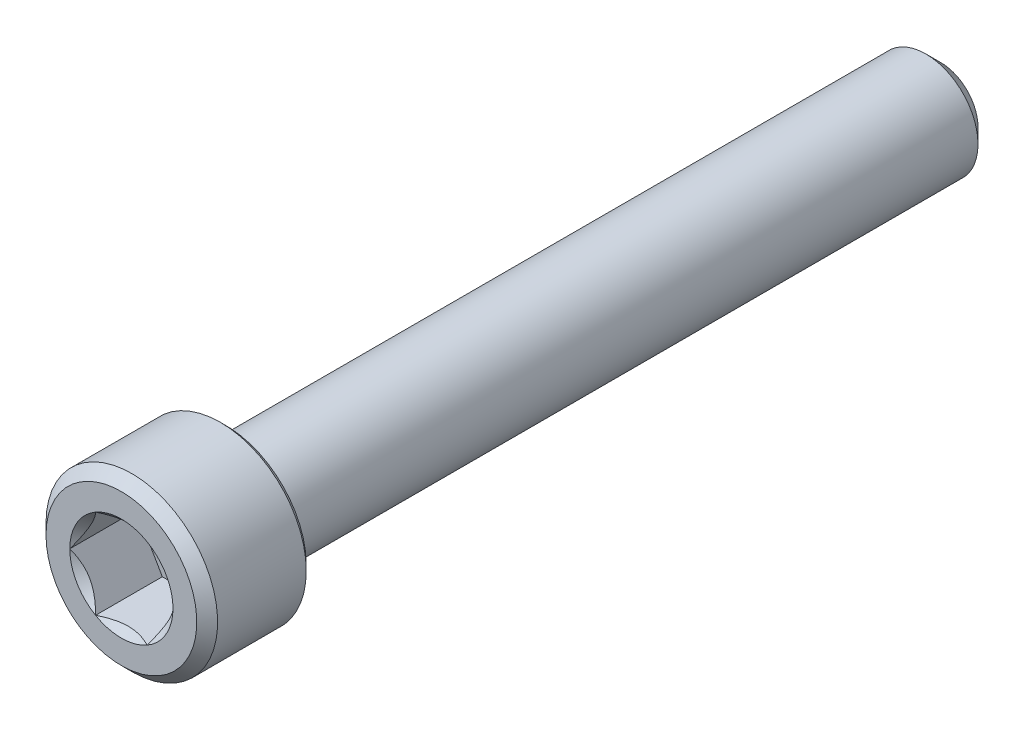
ISO-10303-21;
HEADER;
FILE_DESCRIPTION(('STEP AP214'),'2;1');
FILE_NAME('part.step','',(''),(''),'','','');
FILE_SCHEMA(('AUTOMOTIVE_DESIGN { 1 0 10303 214 1 1 1 1 }'));
ENDSEC;
DATA;
#1=APPLICATION_CONTEXT('core data for automotive mechanical design processes');
#2=APPLICATION_PROTOCOL_DEFINITION('international standard','automotive_design',2000,#1);
#3=PRODUCT_CONTEXT('',#1,'mechanical');
#4=PRODUCT('Part','Part','',(#3));
#5=PRODUCT_RELATED_PRODUCT_CATEGORY('part','',(#4));
#6=PRODUCT_DEFINITION_FORMATION('','',#4);
#7=PRODUCT_DEFINITION_CONTEXT('part definition',#1,'design');
#8=PRODUCT_DEFINITION('design','',#6,#7);
#9=PRODUCT_DEFINITION_SHAPE('','',#8);
#10=(LENGTH_UNIT() NAMED_UNIT(*) SI_UNIT(.MILLI.,.METRE.));
#11=(NAMED_UNIT(*) PLANE_ANGLE_UNIT() SI_UNIT($,.RADIAN.));
#12=(NAMED_UNIT(*) SI_UNIT($,.STERADIAN.) SOLID_ANGLE_UNIT());
#13=UNCERTAINTY_MEASURE_WITH_UNIT(LENGTH_MEASURE(1.E-05),#10,'distance_accuracy_value','');
#14=(GEOMETRIC_REPRESENTATION_CONTEXT(3) GLOBAL_UNCERTAINTY_ASSIGNED_CONTEXT((#13)) GLOBAL_UNIT_ASSIGNED_CONTEXT((#10,
#11,#12)) REPRESENTATION_CONTEXT('',''));
#15=CARTESIAN_POINT('',(0.,0.,0.));
#16=DIRECTION('',(0.,0.,1.));
#17=DIRECTION('',(1.,0.,0.));
#18=AXIS2_PLACEMENT_3D('',#15,#16,#17);
#19=CARTESIAN_POINT('',(0.,0.,30.0736));
#20=DIRECTION('',(0.,0.,1.));
#21=DIRECTION('',(1.,0.,0.));
#22=AXIS2_PLACEMENT_3D('',#19,#20,#21);
#23=PLANE('',#22);
#24=DIRECTION('',(0.5,-0.866025403784438,0.));
#25=VECTOR('',#24,1.);
#26=CARTESIAN_POINT('',(-2.06185637534076,0.,30.0736));
#27=LINE('',#26,#25);
#28=CARTESIAN_POINT('',(-2.06185637534076,0.,30.0736));
#29=VERTEX_POINT('',#28);
#30=CARTESIAN_POINT('',(-1.03092818767038,-1.78562,30.0736));
#31=VERTEX_POINT('',#30);
#32=EDGE_CURVE('E115',#29,#31,#27,.T.);
#33=ORIENTED_EDGE('',*,*,#32,.T.);
#34=DIRECTION('',(1.,0.,0.));
#35=VECTOR('',#34,1.);
#36=CARTESIAN_POINT('',(-1.03092818767038,-1.78562,30.0736));
#37=LINE('',#36,#35);
#38=CARTESIAN_POINT('',(1.03092818767038,-1.78562,30.0736));
#39=VERTEX_POINT('',#38);
#40=EDGE_CURVE('E82',#31,#39,#37,.T.);
#41=ORIENTED_EDGE('',*,*,#40,.T.);
#42=DIRECTION('',(0.5,0.866025403784439,0.));
#43=VECTOR('',#42,1.);
#44=CARTESIAN_POINT('',(1.03092818767038,-1.78562,30.0736));
#45=LINE('',#44,#43);
#46=CARTESIAN_POINT('',(2.06185637534076,0.,30.0736));
#47=VERTEX_POINT('',#46);
#48=EDGE_CURVE('E84',#39,#47,#45,.T.);
#49=ORIENTED_EDGE('',*,*,#48,.T.);
#50=DIRECTION('',(-0.5,0.866025403784439,0.));
#51=VECTOR('',#50,1.);
#52=CARTESIAN_POINT('',(2.06185637534076,0.,30.0736));
#53=LINE('',#52,#51);
#54=CARTESIAN_POINT('',(1.03092818767038,1.78562,30.0736));
#55=VERTEX_POINT('',#54);
#56=EDGE_CURVE('E85',#47,#55,#53,.T.);
#57=ORIENTED_EDGE('',*,*,#56,.T.);
#58=DIRECTION('',(-1.,0.,0.));
#59=VECTOR('',#58,1.);
#60=CARTESIAN_POINT('',(1.03092818767038,1.78562,30.0736));
#61=LINE('',#60,#59);
#62=CARTESIAN_POINT('',(-1.03092818767038,1.78562,30.0736));
#63=VERTEX_POINT('',#62);
#64=EDGE_CURVE('E71',#55,#63,#61,.T.);
#65=ORIENTED_EDGE('',*,*,#64,.T.);
#66=DIRECTION('',(-0.5,-0.866025403784439,0.));
#67=VECTOR('',#66,1.);
#68=CARTESIAN_POINT('',(-1.03092818767038,1.78562,30.0736));
#69=LINE('',#68,#67);
#70=EDGE_CURVE('E110',#63,#29,#69,.T.);
#71=ORIENTED_EDGE('',*,*,#70,.T.);
#72=EDGE_LOOP('',(#33,#41,#49,#57,#65,#71));
#73=FACE_BOUND('',#72,.T.);
#74=ADVANCED_FACE('F17',(#73),#23,.T.);
#75=CARTESIAN_POINT('',(2.06185637534076,0.,30.0736));
#76=DIRECTION('',(0.866025403784439,0.5,0.));
#77=DIRECTION('',(-0.5,0.866025403784439,0.));
#78=AXIS2_PLACEMENT_3D('',#75,#76,#77);
#79=PLANE('',#78);
#80=CARTESIAN_POINT('',(2.06185637534184,-1.87021565505749E-12,32.7406000000041));
#81=CARTESIAN_POINT('',(2.02642287007562,0.0613726314094752,32.7052004995166));
#82=CARTESIAN_POINT('',(1.99039691583455,0.123771414546173,32.6718804146153));
#83=CARTESIAN_POINT('',(1.9169362980726,0.251008936865267,32.6108727616067));
#84=CARTESIAN_POINT('',(1.8794946522605,0.315859769730815,32.5832191270456));
#85=CARTESIAN_POINT('',(1.80399541010736,0.446628293073005,32.535848264898));
#86=CARTESIAN_POINT('',(1.76595703078219,0.512512698701769,32.5160120045732));
#87=CARTESIAN_POINT('',(1.68904308953817,0.645731552746788,32.4854504677353));
#88=CARTESIAN_POINT('',(1.65016987554121,0.713061934443009,32.4747023867414));
#89=CARTESIAN_POINT('',(1.58317010137767,0.829108947389912,32.4650045880257));
#90=CARTESIAN_POINT('',(1.55513003782825,0.87767576210496,32.4635694330325));
#91=CARTESIAN_POINT('',(1.49909578618237,0.974729932919726,32.4659903582832));
#92=CARTESIAN_POINT('',(1.47110161760838,1.02321725520553,32.4698482931523));
#93=CARTESIAN_POINT('',(1.41538537197334,1.11972062345241,32.4826340723218));
#94=CARTESIAN_POINT('',(1.38766354396567,1.16773623804037,32.4915661844237));
#95=CARTESIAN_POINT('',(1.33268389705775,1.26296377986708,32.5140154678973));
#96=CARTESIAN_POINT('',(1.30542630540885,1.31017531349495,32.5275348206843));
#97=CARTESIAN_POINT('',(1.23563624998288,1.43105523535577,32.5676550620315));
#98=CARTESIAN_POINT('',(1.19353588652263,1.50397520388604,32.5972754050953));
#99=CARTESIAN_POINT('',(1.13163053076445,1.61119842531984,32.6472771620127));
#100=CARTESIAN_POINT('',(1.11122988523966,1.64653337987598,32.6648452543044));
#101=CARTESIAN_POINT('',(1.07080633249522,1.71654902705178,32.7015826683191));
#102=CARTESIAN_POINT('',(1.05078320287217,1.75123010488545,32.7207510087135));
#103=CARTESIAN_POINT('',(1.0309281876693,1.78562000000187,32.7406000000041));
#104=B_SPLINE_CURVE_WITH_KNOTS('',3,(#80,#81,#82,#83,#84,#85,#86,#87,#88,#89,#90,#91,#92,#93,
#94,#95,#96,#97,#98,#99,#100,#101,#102,#103),.UNSPECIFIED.,.F.,.F.,(4,2,2,2,2,2,2,2,2,2,2,4),
(0.,0.237814133073906,0.477013279274041,0.712414751828504,0.947223776272302,1.11528104359305,
1.28339721088455,1.45165498753189,1.61999288984356,1.88720880279873,2.0204543003604,
2.15361867898024),.UNSPECIFIED.);
#105=CARTESIAN_POINT('',(2.06185637534474,0.,32.740600000007));
#106=VERTEX_POINT('',#105);
#107=CARTESIAN_POINT('',(1.03092818767781,1.78562000000094,32.7406000000076));
#108=VERTEX_POINT('',#107);
#109=EDGE_CURVE('E20',#106,#108,#104,.T.);
#110=ORIENTED_EDGE('',*,*,#109,.T.);
#111=DIRECTION('',(0.,0.,1.));
#112=VECTOR('',#111,1.);
#113=CARTESIAN_POINT('',(1.03092818767038,1.78562,30.0736));
#114=LINE('',#113,#112);
#115=EDGE_CURVE('E90',#108,#55,#114,.F.);
#116=ORIENTED_EDGE('',*,*,#115,.T.);
#117=ORIENTED_EDGE('',*,*,#56,.F.);
#118=DIRECTION('',(0.,0.,1.));
#119=VECTOR('',#118,1.);
#120=CARTESIAN_POINT('',(2.06185637534076,0.,30.0736));
#121=LINE('',#120,#119);
#122=EDGE_CURVE('E58',#47,#106,#121,.T.);
#123=ORIENTED_EDGE('',*,*,#122,.T.);
#124=EDGE_LOOP('',(#110,#116,#117,#123));
#125=FACE_BOUND('',#124,.T.);
#126=ADVANCED_FACE('F89',(#125),#79,.F.);
#127=CARTESIAN_POINT('',(1.03092818767038,-1.78562,30.0736));
#128=DIRECTION('',(0.866025403784439,-0.5,0.));
#129=DIRECTION('',(0.5,0.866025403784439,0.));
#130=AXIS2_PLACEMENT_3D('',#127,#128,#129);
#131=PLANE('',#130);
#132=CARTESIAN_POINT('',(1.0309281876693,-1.78562000000187,32.7406000000041));
#133=CARTESIAN_POINT('',(1.06636169293551,-1.72424736859053,32.7052004995166));
#134=CARTESIAN_POINT('',(1.10238764717659,-1.66184858545383,32.6718804146153));
#135=CARTESIAN_POINT('',(1.17584826493854,-1.53461106313473,32.6108727616067));
#136=CARTESIAN_POINT('',(1.21328991075064,-1.46976023026919,32.5832191270456));
#137=CARTESIAN_POINT('',(1.28878915290378,-1.338991706927,32.535848264898));
#138=CARTESIAN_POINT('',(1.32682753222895,-1.27310730129823,32.5160120045732));
#139=CARTESIAN_POINT('',(1.40374147347297,-1.13988844725321,32.4854504677353));
#140=CARTESIAN_POINT('',(1.44261468746992,-1.07255806555699,32.4747023867414));
#141=CARTESIAN_POINT('',(1.50961446163347,-0.956511052610089,32.4650045880257));
#142=CARTESIAN_POINT('',(1.53765452518289,-0.907944237895041,32.4635694330325));
#143=CARTESIAN_POINT('',(1.59368877682877,-0.810890067080274,32.4659903582832));
#144=CARTESIAN_POINT('',(1.62168294540276,-0.762402744794476,32.4698482931523));
#145=CARTESIAN_POINT('',(1.6773991910378,-0.665899376547594,32.4826340723218));
#146=CARTESIAN_POINT('',(1.70512101904547,-0.617883761959627,32.4915661844237));
#147=CARTESIAN_POINT('',(1.76010066595338,-0.522656220132923,32.5140154678973));
#148=CARTESIAN_POINT('',(1.78735825760229,-0.475444686505049,32.5275348206843));
#149=CARTESIAN_POINT('',(1.85714831302826,-0.354564764644227,32.5676550620315));
#150=CARTESIAN_POINT('',(1.8992486764885,-0.281644796113963,32.5972754050953));
#151=CARTESIAN_POINT('',(1.96115403224669,-0.174421574680155,32.6472771620127));
#152=CARTESIAN_POINT('',(1.98155467777148,-0.139086620124017,32.6648452543044));
#153=CARTESIAN_POINT('',(2.02197823051592,-0.0690709729482142,32.7015826683191));
#154=CARTESIAN_POINT('',(2.04200136013897,-0.0343898951145474,32.7207510087135));
#155=CARTESIAN_POINT('',(2.06185637534184,1.87207923570105E-12,32.7406000000041));
#156=B_SPLINE_CURVE_WITH_KNOTS('',3,(#132,#133,#134,#135,#136,#137,#138,#139,#140,#141,#142,
#143,#144,#145,#146,#147,#148,#149,#150,#151,#152,#153,#154,#155),.UNSPECIFIED.,.F.,.F.,(4,2,2,
2,2,2,2,2,2,2,2,4),(0.,0.237814133073905,0.477013279274041,0.712414751828502,0.947223776272302,
1.11528104359305,1.28339721088455,1.45165498753188,1.61999288984356,1.88720880279873,
2.0204543003604,2.15361867898025),.UNSPECIFIED.);
#157=CARTESIAN_POINT('',(1.03092818767237,-1.78562000000345,32.740600000007));
#158=VERTEX_POINT('',#157);
#159=EDGE_CURVE('E94',#158,#106,#156,.T.);
#160=ORIENTED_EDGE('',*,*,#159,.T.);
#161=ORIENTED_EDGE('',*,*,#122,.F.);
#162=ORIENTED_EDGE('',*,*,#48,.F.);
#163=DIRECTION('',(0.,0.,-1.));
#164=VECTOR('',#163,1.);
#165=CARTESIAN_POINT('',(1.03092818767038,-1.78562,30.0736));
#166=LINE('',#165,#164);
#167=EDGE_CURVE('E96',#39,#158,#166,.F.);
#168=ORIENTED_EDGE('',*,*,#167,.T.);
#169=EDGE_LOOP('',(#160,#161,#162,#168));
#170=FACE_BOUND('',#169,.T.);
#171=ADVANCED_FACE('F92',(#170),#131,.F.);
#172=CARTESIAN_POINT('',(-1.03092818767038,-1.78562,30.0736));
#173=DIRECTION('',(0.,-1.,0.));
#174=DIRECTION('',(0.,0.,-1.));
#175=AXIS2_PLACEMENT_3D('',#172,#173,#174);
#176=PLANE('',#175);
#177=CARTESIAN_POINT('',(-1.03092818767254,-1.78562,32.7406000000041));
#178=CARTESIAN_POINT('',(-0.960061177127587,-1.78562,32.7052004995176));
#179=CARTESIAN_POINT('',(-0.888009268632836,-1.78562,32.6718804146178));
#180=CARTESIAN_POINT('',(-0.741088033083753,-1.78562,32.6108727616135));
#181=CARTESIAN_POINT('',(-0.666204741446977,-1.78562,32.5832191270553));
#182=CARTESIAN_POINT('',(-0.515206257116187,-1.78562,32.5358482649152));
#183=CARTESIAN_POINT('',(-0.43912949845394,-1.78562,32.5160120045949));
#184=CARTESIAN_POINT('',(-0.28530161594267,-1.78562,32.4854504677676));
#185=CARTESIAN_POINT('',(-0.207555187937457,-1.78562,32.4747023867798));
#186=CARTESIAN_POINT('',(-0.0735556395841561,-1.78562,32.465004588075));
#187=CARTESIAN_POINT('',(-0.0174755124701572,-1.78562,32.4635694330869));
#188=CARTESIAN_POINT('',(0.0945929908513759,-1.78562,32.4659903583497));
#189=CARTESIAN_POINT('',(0.150581328013958,-1.78562,32.4698482932257));
#190=CARTESIAN_POINT('',(0.262013819312583,-1.78562,32.4826340724102));
#191=CARTESIAN_POINT('',(0.317457475341856,-1.78562,32.4915661845202));
#192=CARTESIAN_POINT('',(0.427416769184933,-1.78562,32.5140154680107));
#193=CARTESIAN_POINT('',(0.481931952496061,-1.78562,32.5275348208065));
#194=CARTESIAN_POINT('',(0.621512063303938,-1.78562,32.5676550621545));
#195=CARTESIAN_POINT('',(0.705712790169282,-1.78562,32.5972754052014));
#196=CARTESIAN_POINT('',(0.829523501606724,-1.78562,32.6472771620848));
#197=CARTESIAN_POINT('',(0.87032479263054,-1.78562,32.6648452543636));
#198=CARTESIAN_POINT('',(0.951171898069165,-1.78562,32.7015826683503));
#199=CARTESIAN_POINT('',(0.991218157290788,-1.78562,32.7207510087296));
#200=CARTESIAN_POINT('',(1.03092818767254,-1.78562,32.7406000000041));
#201=B_SPLINE_CURVE_WITH_KNOTS('',3,(#177,#178,#179,#180,#181,#182,#183,#184,#185,#186,#187,
#188,#189,#190,#191,#192,#193,#194,#195,#196,#197,#198,#199,#200),.UNSPECIFIED.,.F.,.F.,(4,2,2,
2,2,2,2,2,2,2,2,4),(0.,0.237814133106243,0.47701327933873,0.712414751924246,0.94722377639907,
1.11528104376481,1.28339721110135,1.45165498779379,1.61999289015057,1.88720880293443,
2.0204543004099,2.15361867894394),.UNSPECIFIED.);
#202=CARTESIAN_POINT('',(-1.03092818767237,-1.78562000000345,32.740600000007));
#203=VERTEX_POINT('',#202);
#204=EDGE_CURVE('E197',#203,#158,#201,.T.);
#205=ORIENTED_EDGE('',*,*,#204,.T.);
#206=ORIENTED_EDGE('',*,*,#167,.F.);
#207=ORIENTED_EDGE('',*,*,#40,.F.);
#208=DIRECTION('',(0.,0.,1.));
#209=VECTOR('',#208,1.);
#210=CARTESIAN_POINT('',(-1.03092818767038,-1.78562,30.0736));
#211=LINE('',#210,#209);
#212=EDGE_CURVE('E112',#31,#203,#211,.T.);
#213=ORIENTED_EDGE('',*,*,#212,.T.);
#214=EDGE_LOOP('',(#205,#206,#207,#213));
#215=FACE_BOUND('',#214,.T.);
#216=ADVANCED_FACE('F206',(#215),#176,.F.);
#217=CARTESIAN_POINT('',(-2.06185637534076,0.,30.0736));
#218=DIRECTION('',(-0.866025403784438,-0.5,0.));
#219=DIRECTION('',(0.5,-0.866025403784438,0.));
#220=AXIS2_PLACEMENT_3D('',#217,#218,#219);
#221=PLANE('',#220);
#222=CARTESIAN_POINT('',(-2.06185637534184,1.87116226081698E-12,32.7406000000041));
#223=CARTESIAN_POINT('',(-2.02642287007562,-0.061372631409474,32.7052004995166));
#224=CARTESIAN_POINT('',(-1.99039691583455,-0.123771414546172,32.6718804146153));
#225=CARTESIAN_POINT('',(-1.9169362980726,-0.251008936865266,32.6108727616067));
#226=CARTESIAN_POINT('',(-1.8794946522605,-0.315859769730814,32.5832191270456));
#227=CARTESIAN_POINT('',(-1.80399541010736,-0.446628293073004,32.535848264898));
#228=CARTESIAN_POINT('',(-1.76595703078219,-0.512512698701769,32.5160120045732));
#229=CARTESIAN_POINT('',(-1.68904308953817,-0.645731552746788,32.4854504677353));
#230=CARTESIAN_POINT('',(-1.65016987554121,-0.713061934443008,32.4747023867414));
#231=CARTESIAN_POINT('',(-1.58317010137767,-0.829108947389912,32.4650045880257));
#232=CARTESIAN_POINT('',(-1.55513003782825,-0.877675762104959,32.4635694330325));
#233=CARTESIAN_POINT('',(-1.49909578618237,-0.974729932919726,32.4659903582832));
#234=CARTESIAN_POINT('',(-1.47110161760838,-1.02321725520552,32.4698482931523));
#235=CARTESIAN_POINT('',(-1.41538537197334,-1.11972062345241,32.4826340723218));
#236=CARTESIAN_POINT('',(-1.38766354396567,-1.16773623804037,32.4915661844237));
#237=CARTESIAN_POINT('',(-1.33268389705775,-1.26296377986708,32.5140154678973));
#238=CARTESIAN_POINT('',(-1.30542630540885,-1.31017531349495,32.5275348206843));
#239=CARTESIAN_POINT('',(-1.23563624998288,-1.43105523535577,32.5676550620315));
#240=CARTESIAN_POINT('',(-1.19353588652263,-1.50397520388604,32.5972754050953));
#241=CARTESIAN_POINT('',(-1.13163053076444,-1.61119842531984,32.6472771620127));
#242=CARTESIAN_POINT('',(-1.11122988523966,-1.64653337987598,32.6648452543044));
#243=CARTESIAN_POINT('',(-1.07080633249522,-1.71654902705179,32.7015826683191));
#244=CARTESIAN_POINT('',(-1.05078320287217,-1.75123010488545,32.7207510087135));
#245=CARTESIAN_POINT('',(-1.0309281876693,-1.78562000000187,32.7406000000041));
#246=B_SPLINE_CURVE_WITH_KNOTS('',3,(#222,#223,#224,#225,#226,#227,#228,#229,#230,#231,#232,
#233,#234,#235,#236,#237,#238,#239,#240,#241,#242,#243,#244,#245),.UNSPECIFIED.,.F.,.F.,(4,2,2,
2,2,2,2,2,2,2,2,4),(0.,0.237814133073906,0.477013279274041,0.712414751828504,0.947223776272303,
1.11528104359306,1.28339721088455,1.45165498753189,1.61999288984356,1.88720880279873,
2.0204543003604,2.15361867898025),.UNSPECIFIED.);
#247=CARTESIAN_POINT('',(-2.06185637534474,0.,32.740600000007));
#248=VERTEX_POINT('',#247);
#249=EDGE_CURVE('E190',#248,#203,#246,.T.);
#250=ORIENTED_EDGE('',*,*,#249,.T.);
#251=ORIENTED_EDGE('',*,*,#212,.F.);
#252=ORIENTED_EDGE('',*,*,#32,.F.);
#253=DIRECTION('',(0.,0.,1.));
#254=VECTOR('',#253,1.);
#255=CARTESIAN_POINT('',(-2.06185637534076,0.,30.0736));
#256=LINE('',#255,#254);
#257=EDGE_CURVE('E107',#29,#248,#256,.T.);
#258=ORIENTED_EDGE('',*,*,#257,.T.);
#259=EDGE_LOOP('',(#250,#251,#252,#258));
#260=FACE_BOUND('',#259,.T.);
#261=ADVANCED_FACE('F202',(#260),#221,.F.);
#262=CARTESIAN_POINT('',(-1.03092818767038,1.78562,30.0736));
#263=DIRECTION('',(-0.866025403784439,0.5,0.));
#264=DIRECTION('',(-0.5,-0.866025403784439,0.));
#265=AXIS2_PLACEMENT_3D('',#262,#263,#264);
#266=PLANE('',#265);
#267=CARTESIAN_POINT('',(-1.0309281876693,1.78562000000187,32.7406000000041));
#268=CARTESIAN_POINT('',(-1.06636169293552,1.72424736859053,32.7052004995166));
#269=CARTESIAN_POINT('',(-1.10238764717659,1.66184858545383,32.6718804146153));
#270=CARTESIAN_POINT('',(-1.17584826493854,1.53461106313473,32.6108727616067));
#271=CARTESIAN_POINT('',(-1.21328991075064,1.46976023026919,32.5832191270456));
#272=CARTESIAN_POINT('',(-1.28878915290378,1.338991706927,32.535848264898));
#273=CARTESIAN_POINT('',(-1.32682753222895,1.27310730129823,32.5160120045732));
#274=CARTESIAN_POINT('',(-1.40374147347297,1.13988844725321,32.4854504677353));
#275=CARTESIAN_POINT('',(-1.44261468746993,1.07255806555699,32.4747023867414));
#276=CARTESIAN_POINT('',(-1.50961446163347,0.956511052610089,32.4650045880257));
#277=CARTESIAN_POINT('',(-1.53765452518289,0.907944237895041,32.4635694330325));
#278=CARTESIAN_POINT('',(-1.59368877682877,0.810890067080275,32.4659903582832));
#279=CARTESIAN_POINT('',(-1.62168294540276,0.762402744794476,32.4698482931523));
#280=CARTESIAN_POINT('',(-1.6773991910378,0.665899376547594,32.4826340723218));
#281=CARTESIAN_POINT('',(-1.70512101904547,0.617883761959628,32.4915661844237));
#282=CARTESIAN_POINT('',(-1.76010066595338,0.522656220132923,32.5140154678973));
#283=CARTESIAN_POINT('',(-1.78735825760229,0.47544468650505,32.5275348206843));
#284=CARTESIAN_POINT('',(-1.85714831302826,0.354564764644227,32.5676550620315));
#285=CARTESIAN_POINT('',(-1.89924867648851,0.281644796113964,32.5972754050953));
#286=CARTESIAN_POINT('',(-1.96115403224669,0.174421574680157,32.6472771620127));
#287=CARTESIAN_POINT('',(-1.98155467777148,0.139086620124018,32.6648452543044));
#288=CARTESIAN_POINT('',(-2.02197823051592,0.069070972948216,32.7015826683191));
#289=CARTESIAN_POINT('',(-2.04200136013897,0.0343898951145491,32.7207510087135));
#290=CARTESIAN_POINT('',(-2.06185637534184,-1.8704331825972E-12,32.7406000000041));
#291=B_SPLINE_CURVE_WITH_KNOTS('',3,(#267,#268,#269,#270,#271,#272,#273,#274,#275,#276,#277,
#278,#279,#280,#281,#282,#283,#284,#285,#286,#287,#288,#289,#290),.UNSPECIFIED.,.F.,.F.,(4,2,2,
2,2,2,2,2,2,2,2,4),(0.,0.237814133073906,0.477013279274041,0.712414751828502,0.947223776272302,
1.11528104359305,1.28339721088455,1.45165498753188,1.61999288984356,1.88720880279873,
2.0204543003604,2.15361867898024),.UNSPECIFIED.);
#292=CARTESIAN_POINT('',(-1.03092818767237,1.78562000000345,32.740600000007));
#293=VERTEX_POINT('',#292);
#294=EDGE_CURVE('E161',#293,#248,#291,.T.);
#295=ORIENTED_EDGE('',*,*,#294,.T.);
#296=ORIENTED_EDGE('',*,*,#257,.F.);
#297=ORIENTED_EDGE('',*,*,#70,.F.);
#298=DIRECTION('',(0.,0.,1.));
#299=VECTOR('',#298,1.);
#300=CARTESIAN_POINT('',(-1.03092818767038,1.78562,30.0736));
#301=LINE('',#300,#299);
#302=EDGE_CURVE('E39',#63,#293,#301,.T.);
#303=ORIENTED_EDGE('',*,*,#302,.T.);
#304=EDGE_LOOP('',(#295,#296,#297,#303));
#305=FACE_BOUND('',#304,.T.);
#306=ADVANCED_FACE('F205',(#305),#266,.F.);
#307=CARTESIAN_POINT('',(1.03092818767038,1.78562,30.0736));
#308=DIRECTION('',(0.,1.,0.));
#309=DIRECTION('',(-1.,0.,0.));
#310=AXIS2_PLACEMENT_3D('',#307,#308,#309);
#311=PLANE('',#310);
#312=CARTESIAN_POINT('',(1.03092818767254,1.78562,32.7406000000041));
#313=CARTESIAN_POINT('',(0.960061177140108,1.78562,32.7052004995166));
#314=CARTESIAN_POINT('',(0.888009268657953,1.78562,32.6718804146153));
#315=CARTESIAN_POINT('',(0.741088033134053,1.78562,32.6108727616067));
#316=CARTESIAN_POINT('',(0.666204741509862,1.78562,32.5832191270456));
#317=CARTESIAN_POINT('',(0.515206257203576,1.78562,32.535848264898));
#318=CARTESIAN_POINT('',(0.439129498553245,1.78562,32.5160120045732));
#319=CARTESIAN_POINT('',(0.285301616065195,1.78562,32.4854504677353));
#320=CARTESIAN_POINT('',(0.207555188071288,1.78562,32.4747023867414));
#321=CARTESIAN_POINT('',(0.0735556397441945,1.78562,32.4650045880257));
#322=CARTESIAN_POINT('',(0.0174755126453635,1.78562,32.4635694330325));
#323=CARTESIAN_POINT('',(-0.0945929906463993,1.78562,32.4659903582832));
#324=CARTESIAN_POINT('',(-0.15058132779438,1.78562,32.4698482931523));
#325=CARTESIAN_POINT('',(-0.262013819064465,1.78562,32.4826340723218));
#326=CARTESIAN_POINT('',(-0.3174574750798,1.78562,32.4915661844237));
#327=CARTESIAN_POINT('',(-0.427416768895629,1.78562,32.5140154678973));
#328=CARTESIAN_POINT('',(-0.481931952193445,1.78562,32.5275348206843));
#329=CARTESIAN_POINT('',(-0.621512063045379,1.78562,32.5676550620315));
#330=CARTESIAN_POINT('',(-0.705712789965875,1.78562,32.5972754050952));
#331=CARTESIAN_POINT('',(-0.829523501482249,1.78562,32.6472771620127));
#332=CARTESIAN_POINT('',(-0.870324792531827,1.78562,32.6648452543044));
#333=CARTESIAN_POINT('',(-0.951171898020696,1.78562,32.7015826683191));
#334=CARTESIAN_POINT('',(-0.991218157266803,1.78562,32.7207510087136));
#335=CARTESIAN_POINT('',(-1.03092818767254,1.78562,32.7406000000041));
#336=B_SPLINE_CURVE_WITH_KNOTS('',3,(#312,#313,#314,#315,#316,#317,#318,#319,#320,#321,#322,
#323,#324,#325,#326,#327,#328,#329,#330,#331,#332,#333,#334,#335),.UNSPECIFIED.,.F.,.F.,(4,2,2,
2,2,2,2,2,2,2,2,4),(0.,0.237814133073906,0.477013279274041,0.712414751828502,0.947223776272302,
1.11528104359305,1.28339721088455,1.45165498753188,1.61999288984356,1.88720880279873,
2.0204543003604,2.15361867898024),.UNSPECIFIED.);
#337=EDGE_CURVE('E154',#108,#293,#336,.T.);
#338=ORIENTED_EDGE('',*,*,#337,.T.);
#339=ORIENTED_EDGE('',*,*,#302,.F.);
#340=ORIENTED_EDGE('',*,*,#64,.F.);
#341=ORIENTED_EDGE('',*,*,#115,.F.);
#342=EDGE_LOOP('',(#338,#339,#340,#341));
#343=FACE_BOUND('',#342,.T.);
#344=ADVANCED_FACE('F168',(#343),#311,.F.);
#345=CARTESIAN_POINT('',(0.,0.,32.7405999999542));
#346=DIRECTION('',(0.,0.,1.));
#347=DIRECTION('',(1.,0.,0.));
#348=AXIS2_PLACEMENT_3D('',#345,#346,#347);
#349=CONICAL_SURFACE('',#348,2.06185637529188,0.785398163397448);
#350=ORIENTED_EDGE('',*,*,#109,.F.);
#351=CARTESIAN_POINT('',(0.,0.,32.740600000011));
#352=DIRECTION('',(0.,0.,1.));
#353=DIRECTION('',(1.,0.,0.));
#354=AXIS2_PLACEMENT_3D('',#351,#352,#353);
#355=CIRCLE('',#354,2.06185637534873);
#356=EDGE_CURVE('E151',#108,#106,#355,.F.);
#357=ORIENTED_EDGE('',*,*,#356,.F.);
#358=EDGE_LOOP('',(#350,#357));
#359=FACE_BOUND('',#358,.T.);
#360=ADVANCED_FACE('F222',(#359),#349,.F.);
#361=CARTESIAN_POINT('',(0.,0.,32.7405999999542));
#362=DIRECTION('',(0.,0.,1.));
#363=DIRECTION('',(1.,0.,0.));
#364=AXIS2_PLACEMENT_3D('',#361,#362,#363);
#365=CONICAL_SURFACE('',#364,2.06185637529188,0.785398163397448);
#366=ORIENTED_EDGE('',*,*,#159,.F.);
#367=CARTESIAN_POINT('',(0.,0.,32.740600000011));
#368=DIRECTION('',(0.,0.,1.));
#369=DIRECTION('',(1.,0.,0.));
#370=AXIS2_PLACEMENT_3D('',#367,#368,#369);
#371=CIRCLE('',#370,2.06185637534873);
#372=EDGE_CURVE('E148',#106,#158,#371,.F.);
#373=ORIENTED_EDGE('',*,*,#372,.F.);
#374=EDGE_LOOP('',(#366,#373));
#375=FACE_BOUND('',#374,.T.);
#376=ADVANCED_FACE('F219',(#375),#365,.F.);
#377=CARTESIAN_POINT('',(0.,0.,32.7405999999542));
#378=DIRECTION('',(0.,0.,1.));
#379=DIRECTION('',(1.,0.,0.));
#380=AXIS2_PLACEMENT_3D('',#377,#378,#379);
#381=CONICAL_SURFACE('',#380,2.06185637529188,0.785398163499717);
#382=ORIENTED_EDGE('',*,*,#204,.F.);
#383=CARTESIAN_POINT('',(0.,0.,32.740600000011));
#384=DIRECTION('',(0.,0.,1.));
#385=DIRECTION('',(1.,0.,0.));
#386=AXIS2_PLACEMENT_3D('',#383,#384,#385);
#387=CIRCLE('',#386,2.06185637534873);
#388=EDGE_CURVE('E145',#158,#203,#387,.F.);
#389=ORIENTED_EDGE('',*,*,#388,.F.);
#390=EDGE_LOOP('',(#382,#389));
#391=FACE_BOUND('',#390,.T.);
#392=ADVANCED_FACE('F186',(#391),#381,.F.);
#393=CARTESIAN_POINT('',(0.,0.,32.7405999999542));
#394=DIRECTION('',(0.,0.,1.));
#395=DIRECTION('',(1.,0.,0.));
#396=AXIS2_PLACEMENT_3D('',#393,#394,#395);
#397=CONICAL_SURFACE('',#396,2.06185637529188,0.785398163397448);
#398=ORIENTED_EDGE('',*,*,#249,.F.);
#399=CARTESIAN_POINT('',(0.,0.,32.740600000011));
#400=DIRECTION('',(0.,0.,1.));
#401=DIRECTION('',(1.,0.,0.));
#402=AXIS2_PLACEMENT_3D('',#399,#400,#401);
#403=CIRCLE('',#402,2.06185637534873);
#404=EDGE_CURVE('E142',#203,#248,#403,.F.);
#405=ORIENTED_EDGE('',*,*,#404,.F.);
#406=EDGE_LOOP('',(#398,#405));
#407=FACE_BOUND('',#406,.T.);
#408=ADVANCED_FACE('F181',(#407),#397,.F.);
#409=CARTESIAN_POINT('',(0.,0.,32.7405999999542));
#410=DIRECTION('',(0.,0.,1.));
#411=DIRECTION('',(1.,0.,0.));
#412=AXIS2_PLACEMENT_3D('',#409,#410,#411);
#413=CONICAL_SURFACE('',#412,2.06185637529188,0.785398163397448);
#414=ORIENTED_EDGE('',*,*,#294,.F.);
#415=CARTESIAN_POINT('',(0.,0.,32.740600000011));
#416=DIRECTION('',(0.,0.,1.));
#417=DIRECTION('',(1.,0.,0.));
#418=AXIS2_PLACEMENT_3D('',#415,#416,#417);
#419=CIRCLE('',#418,2.06185637534873);
#420=EDGE_CURVE('E139',#248,#293,#419,.F.);
#421=ORIENTED_EDGE('',*,*,#420,.F.);
#422=EDGE_LOOP('',(#414,#421));
#423=FACE_BOUND('',#422,.T.);
#424=ADVANCED_FACE('F175',(#423),#413,.F.);
#425=CARTESIAN_POINT('',(0.,0.,32.7405999999542));
#426=DIRECTION('',(0.,0.,1.));
#427=DIRECTION('',(1.,0.,0.));
#428=AXIS2_PLACEMENT_3D('',#425,#426,#427);
#429=CONICAL_SURFACE('',#428,2.06185637529188,0.785398163397448);
#430=ORIENTED_EDGE('',*,*,#337,.F.);
#431=CARTESIAN_POINT('',(0.,0.,32.740600000011));
#432=DIRECTION('',(0.,0.,1.));
#433=DIRECTION('',(1.,0.,0.));
#434=AXIS2_PLACEMENT_3D('',#431,#432,#433);
#435=CIRCLE('',#434,2.06185637534873);
#436=EDGE_CURVE('E136',#293,#108,#435,.F.);
#437=ORIENTED_EDGE('',*,*,#436,.F.);
#438=EDGE_LOOP('',(#430,#437));
#439=FACE_BOUND('',#438,.T.);
#440=ADVANCED_FACE('F170',(#439),#429,.F.);
#441=CARTESIAN_POINT('',(0.,0.,32.7406));
#442=DIRECTION('',(0.,0.,1.));
#443=DIRECTION('',(1.,0.,0.));
#444=AXIS2_PLACEMENT_3D('',#441,#442,#443);
#445=PLANE('',#444);
#446=CARTESIAN_POINT('',(0.,0.,32.740600000011));
#447=DIRECTION('',(0.,0.,-1.));
#448=DIRECTION('',(-1.,0.,0.));
#449=AXIS2_PLACEMENT_3D('',#446,#447,#448);
#450=CIRCLE('',#449,3.01243999996359);
#451=CARTESIAN_POINT('',(-3.01243999996359,0.,32.740600000011));
#452=VERTEX_POINT('',#451);
#453=EDGE_CURVE('E132',#452,#452,#450,.T.);
#454=ORIENTED_EDGE('',*,*,#453,.F.);
#455=EDGE_LOOP('',(#454));
#456=FACE_BOUND('',#455,.T.);
#457=ORIENTED_EDGE('',*,*,#420,.T.);
#458=ORIENTED_EDGE('',*,*,#436,.T.);
#459=ORIENTED_EDGE('',*,*,#356,.T.);
#460=ORIENTED_EDGE('',*,*,#372,.T.);
#461=ORIENTED_EDGE('',*,*,#388,.T.);
#462=ORIENTED_EDGE('',*,*,#404,.T.);
#463=EDGE_LOOP('',(#457,#458,#459,#460,#461,#462));
#464=FACE_BOUND('',#463,.T.);
#465=ADVANCED_FACE('F174',(#456,#464),#445,.T.);
#466=CARTESIAN_POINT('',(0.,0.,32.3240399999349));
#467=DIRECTION('',(0.,0.,-1.));
#468=DIRECTION('',(-1.,0.,0.));
#469=AXIS2_PLACEMENT_3D('',#466,#467,#468);
#470=CONICAL_SURFACE('',#469,3.42900000003965,0.785398163397448);
#471=ORIENTED_EDGE('',*,*,#453,.T.);
#472=EDGE_LOOP('',(#471));
#473=FACE_BOUND('',#472,.T.);
#474=CARTESIAN_POINT('',(0.,0.,32.32404));
#475=DIRECTION('',(0.,0.,-1.));
#476=DIRECTION('',(-1.,0.,0.));
#477=AXIS2_PLACEMENT_3D('',#474,#475,#476);
#478=CIRCLE('',#477,3.429);
#479=CARTESIAN_POINT('',(-3.429,0.,32.32404));
#480=VERTEX_POINT('',#479);
#481=EDGE_CURVE('E135',#480,#480,#478,.T.);
#482=ORIENTED_EDGE('',*,*,#481,.F.);
#483=EDGE_LOOP('',(#482));
#484=FACE_BOUND('',#483,.T.);
#485=ADVANCED_FACE('F258',(#473,#484),#470,.T.);
#486=CARTESIAN_POINT('',(0.,0.,32.7406));
#487=DIRECTION('',(0.,0.,-1.));
#488=DIRECTION('',(-1.,0.,0.));
#489=AXIS2_PLACEMENT_3D('',#486,#487,#488);
#490=CYLINDRICAL_SURFACE('',#489,3.429);
#491=ORIENTED_EDGE('',*,*,#481,.T.);
#492=EDGE_LOOP('',(#491));
#493=FACE_BOUND('',#492,.T.);
#494=CARTESIAN_POINT('',(0.,0.,28.7832800000274));
#495=DIRECTION('',(0.,0.,1.));
#496=DIRECTION('',(1.,0.,0.));
#497=AXIS2_PLACEMENT_3D('',#494,#495,#496);
#498=CIRCLE('',#497,3.42900000003965);
#499=CARTESIAN_POINT('',(3.42900000003965,0.,28.7832800000274));
#500=VERTEX_POINT('',#499);
#501=EDGE_CURVE('E131',#500,#500,#498,.F.);
#502=ORIENTED_EDGE('',*,*,#501,.F.);
#503=EDGE_LOOP('',(#502));
#504=FACE_BOUND('',#503,.T.);
#505=ADVANCED_FACE('F255',(#493,#504),#490,.T.);
#506=CARTESIAN_POINT('',(0.,0.,28.7832799999705));
#507=DIRECTION('',(0.,0.,1.));
#508=DIRECTION('',(0.,-1.,0.));
#509=AXIS2_PLACEMENT_3D('',#506,#507,#508);
#510=CONICAL_SURFACE('',#509,3.42899999992596,0.785398163397448);
#511=CARTESIAN_POINT('',(0.,0.,28.5749999999894));
#512=DIRECTION('',(0.,0.,1.));
#513=DIRECTION('',(0.,-1.,0.));
#514=AXIS2_PLACEMENT_3D('',#511,#512,#513);
#515=CIRCLE('',#514,3.22071999994478);
#516=CARTESIAN_POINT('',(0.,-3.22071999994478,28.5749999999894));
#517=VERTEX_POINT('',#516);
#518=EDGE_CURVE('E128',#517,#517,#515,.T.);
#519=ORIENTED_EDGE('',*,*,#518,.T.);
#520=EDGE_LOOP('',(#519));
#521=FACE_BOUND('',#520,.T.);
#522=ORIENTED_EDGE('',*,*,#501,.T.);
#523=EDGE_LOOP('',(#522));
#524=FACE_BOUND('',#523,.T.);
#525=ADVANCED_FACE('F251',(#521,#524),#510,.T.);
#526=CARTESIAN_POINT('',(0.,0.,0.));
#527=DIRECTION('',(0.,0.,1.));
#528=DIRECTION('',(1.,0.,0.));
#529=AXIS2_PLACEMENT_3D('',#526,#527,#528);
#530=PLANE('',#529);
#531=CARTESIAN_POINT('',(0.,0.,0.));
#532=DIRECTION('',(0.,0.,1.));
#533=DIRECTION('',(1.,0.,0.));
#534=AXIS2_PLACEMENT_3D('',#531,#532,#533);
#535=CIRCLE('',#534,1.48844000000281);
#536=CARTESIAN_POINT('',(1.48844000000281,0.,0.));
#537=VERTEX_POINT('',#536);
#538=EDGE_CURVE('E125',#537,#537,#535,.T.);
#539=ORIENTED_EDGE('',*,*,#538,.F.);
#540=EDGE_LOOP('',(#539));
#541=FACE_BOUND('',#540,.T.);
#542=ADVANCED_FACE('F247',(#541),#530,.F.);
#543=CARTESIAN_POINT('',(0.,0.,28.575));
#544=DIRECTION('',(0.,0.,1.));
#545=DIRECTION('',(1.,0.,0.));
#546=AXIS2_PLACEMENT_3D('',#543,#544,#545);
#547=PLANE('',#546);
#548=CARTESIAN_POINT('',(0.,0.,28.575));
#549=DIRECTION('',(0.,0.,-1.));
#550=DIRECTION('',(-1.,0.,0.));
#551=AXIS2_PLACEMENT_3D('',#548,#549,#550);
#552=CIRCLE('',#551,2.0828);
#553=CARTESIAN_POINT('',(-2.0828,0.,28.575));
#554=VERTEX_POINT('',#553);
#555=EDGE_CURVE('E30',#554,#554,#552,.T.);
#556=ORIENTED_EDGE('',*,*,#555,.F.);
#557=EDGE_LOOP('',(#556));
#558=FACE_BOUND('',#557,.T.);
#559=ORIENTED_EDGE('',*,*,#518,.F.);
#560=EDGE_LOOP('',(#559));
#561=FACE_BOUND('',#560,.T.);
#562=ADVANCED_FACE('F240',(#558,#561),#547,.F.);
#563=CARTESIAN_POINT('',(0.,0.,0.594359999865901));
#564=DIRECTION('',(0.,0.,1.));
#565=DIRECTION('',(1.,0.,0.));
#566=AXIS2_PLACEMENT_3D('',#563,#564,#565);
#567=CONICAL_SURFACE('',#566,2.08279999992556,0.785398163445267);
#568=CARTESIAN_POINT('',(0.,0.,0.594360000000002));
#569=DIRECTION('',(0.,0.,-1.));
#570=DIRECTION('',(-1.,0.,0.));
#571=AXIS2_PLACEMENT_3D('',#568,#569,#570);
#572=CIRCLE('',#571,2.0828);
#573=CARTESIAN_POINT('',(-2.0828,0.,0.594360000000002));
#574=VERTEX_POINT('',#573);
#575=EDGE_CURVE('E11',#574,#574,#572,.F.);
#576=ORIENTED_EDGE('',*,*,#575,.F.);
#577=EDGE_LOOP('',(#576));
#578=FACE_BOUND('',#577,.T.);
#579=ORIENTED_EDGE('',*,*,#538,.T.);
#580=EDGE_LOOP('',(#579));
#581=FACE_BOUND('',#580,.T.);
#582=ADVANCED_FACE('F234',(#578,#581),#567,.T.);
#583=CARTESIAN_POINT('',(0.,0.,28.575));
#584=DIRECTION('',(0.,0.,-1.));
#585=DIRECTION('',(-1.,0.,0.));
#586=AXIS2_PLACEMENT_3D('',#583,#584,#585);
#587=CYLINDRICAL_SURFACE('',#586,2.0828);
#588=ORIENTED_EDGE('',*,*,#575,.T.);
#589=EDGE_LOOP('',(#588));
#590=FACE_BOUND('',#589,.T.);
#591=ORIENTED_EDGE('',*,*,#555,.T.);
#592=EDGE_LOOP('',(#591));
#593=FACE_BOUND('',#592,.T.);
#594=ADVANCED_FACE('F232',(#590,#593),#587,.T.);
#595=CLOSED_SHELL('',(#74,#126,#171,#216,#261,#306,#344,#360,#376,#392,#408,#424,#440,#465,#485,
#505,#525,#542,#562,#582,#594));
#596=MANIFOLD_SOLID_BREP('B1',#595);
#597=ADVANCED_BREP_SHAPE_REPRESENTATION('',(#18,#596),#14);
#598=SHAPE_DEFINITION_REPRESENTATION(#9,#597);
ENDSEC;
END-ISO-10303-21;
